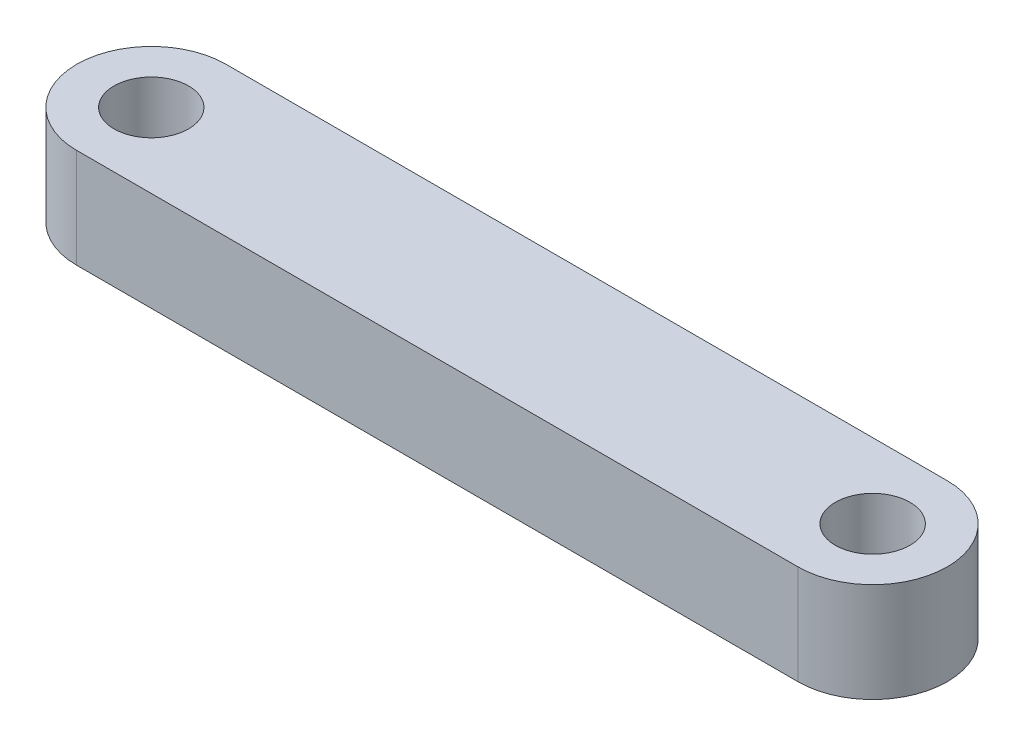
ISO-10303-21;
HEADER;
FILE_DESCRIPTION(('STEP AP214'),'2;1');
FILE_NAME('part.step','',(''),(''),'','','');
FILE_SCHEMA(('AUTOMOTIVE_DESIGN { 1 0 10303 214 1 1 1 1 }'));
ENDSEC;
DATA;
#1=APPLICATION_CONTEXT('core data for automotive mechanical design processes');
#2=APPLICATION_PROTOCOL_DEFINITION('international standard','automotive_design',2000,#1);
#3=PRODUCT_CONTEXT('',#1,'mechanical');
#4=PRODUCT('Part','Part','',(#3));
#5=PRODUCT_RELATED_PRODUCT_CATEGORY('part','',(#4));
#6=PRODUCT_DEFINITION_FORMATION('','',#4);
#7=PRODUCT_DEFINITION_CONTEXT('part definition',#1,'design');
#8=PRODUCT_DEFINITION('design','',#6,#7);
#9=PRODUCT_DEFINITION_SHAPE('','',#8);
#10=(LENGTH_UNIT() NAMED_UNIT(*) SI_UNIT(.MILLI.,.METRE.));
#11=(NAMED_UNIT(*) PLANE_ANGLE_UNIT() SI_UNIT($,.RADIAN.));
#12=(NAMED_UNIT(*) SI_UNIT($,.STERADIAN.) SOLID_ANGLE_UNIT());
#13=UNCERTAINTY_MEASURE_WITH_UNIT(LENGTH_MEASURE(1.E-05),#10,'distance_accuracy_value','');
#14=(GEOMETRIC_REPRESENTATION_CONTEXT(3) GLOBAL_UNCERTAINTY_ASSIGNED_CONTEXT((#13)) GLOBAL_UNIT_ASSIGNED_CONTEXT((#10,
#11,#12)) REPRESENTATION_CONTEXT('',''));
#15=CARTESIAN_POINT('',(0.,0.,0.));
#16=DIRECTION('',(0.,0.,1.));
#17=DIRECTION('',(1.,0.,0.));
#18=AXIS2_PLACEMENT_3D('',#15,#16,#17);
#19=CARTESIAN_POINT('',(-14.9954696871734,4.,-1.3625230433021));
#20=DIRECTION('',(0.,1.,0.));
#21=DIRECTION('',(0.,0.,1.));
#22=AXIS2_PLACEMENT_3D('',#19,#20,#21);
#23=PLANE('',#22);
#24=CARTESIAN_POINT('',(14.0045303530668,4.,-1.36252313888987));
#25=DIRECTION('',(0.,1.,0.));
#26=DIRECTION('',(0.,0.,1.));
#27=AXIS2_PLACEMENT_3D('',#24,#25,#26);
#28=CIRCLE('',#27,1.50000015052541);
#29=CARTESIAN_POINT('',(14.0045303530668,4.,0.13747701163554));
#30=VERTEX_POINT('',#29);
#31=EDGE_CURVE('E112',#30,#30,#28,.T.);
#32=ORIENTED_EDGE('',*,*,#31,.F.);
#33=EDGE_LOOP('',(#32));
#34=FACE_BOUND('',#33,.T.);
#35=CARTESIAN_POINT('',(-14.9954696871734,4.,-1.3625230433021));
#36=DIRECTION('',(0.,1.,0.));
#37=DIRECTION('',(0.,0.,1.));
#38=AXIS2_PLACEMENT_3D('',#35,#36,#37);
#39=CIRCLE('',#38,2.99999750954262);
#40=CARTESIAN_POINT('',(-14.9954696871734,4.,-4.36252055284472));
#41=VERTEX_POINT('',#40);
#42=CARTESIAN_POINT('',(-14.9954696871734,4.,1.63747446624052));
#43=VERTEX_POINT('',#42);
#44=EDGE_CURVE('E92',#41,#43,#39,.T.);
#45=ORIENTED_EDGE('',*,*,#44,.T.);
#46=DIRECTION('',(1.,0.,0.));
#47=VECTOR('',#46,1.);
#48=CARTESIAN_POINT('',(14.0045404200547,4.,1.63747446624052));
#49=LINE('',#48,#47);
#50=CARTESIAN_POINT('',(14.0045404200547,4.,1.63747446624052));
#51=VERTEX_POINT('',#50);
#52=EDGE_CURVE('E87',#43,#51,#49,.T.);
#53=ORIENTED_EDGE('',*,*,#52,.T.);
#54=CARTESIAN_POINT('',(14.0045404200547,4.,-1.3625230433021));
#55=DIRECTION('',(0.,1.,0.));
#56=DIRECTION('',(0.,0.,1.));
#57=AXIS2_PLACEMENT_3D('',#54,#55,#56);
#58=CIRCLE('',#57,2.99999750954262);
#59=CARTESIAN_POINT('',(14.0045404200547,4.,-4.36252055284472));
#60=VERTEX_POINT('',#59);
#61=EDGE_CURVE('E90',#51,#60,#58,.T.);
#62=ORIENTED_EDGE('',*,*,#61,.T.);
#63=DIRECTION('',(-1.,0.,0.));
#64=VECTOR('',#63,1.);
#65=CARTESIAN_POINT('',(-14.9954696871734,4.,-4.36252055284472));
#66=LINE('',#65,#64);
#67=EDGE_CURVE('E57',#60,#41,#66,.T.);
#68=ORIENTED_EDGE('',*,*,#67,.T.);
#69=EDGE_LOOP('',(#45,#53,#62,#68));
#70=FACE_BOUND('',#69,.T.);
#71=CARTESIAN_POINT('',(-14.9936776207104,4.,-1.35896826009357));
#72=DIRECTION('',(0.,1.,0.));
#73=DIRECTION('',(0.,0.,1.));
#74=AXIS2_PLACEMENT_3D('',#71,#72,#73);
#75=CIRCLE('',#74,1.49852008747108);
#76=CARTESIAN_POINT('',(-14.9936776207104,4.,0.139551827377501));
#77=VERTEX_POINT('',#76);
#78=EDGE_CURVE('E134',#77,#77,#75,.T.);
#79=ORIENTED_EDGE('',*,*,#78,.F.);
#80=EDGE_LOOP('',(#79));
#81=FACE_BOUND('',#80,.T.);
#82=ADVANCED_FACE('F39',(#34,#70,#81),#23,.T.);
#83=CARTESIAN_POINT('',(-14.9954696871734,0.,-1.3625230433021));
#84=DIRECTION('',(0.,1.,0.));
#85=DIRECTION('',(0.,0.,1.));
#86=AXIS2_PLACEMENT_3D('',#83,#84,#85);
#87=PLANE('',#86);
#88=CARTESIAN_POINT('',(-14.9954696871734,0.,-1.3625230433021));
#89=DIRECTION('',(0.,1.,0.));
#90=DIRECTION('',(0.,0.,1.));
#91=AXIS2_PLACEMENT_3D('',#88,#89,#90);
#92=CIRCLE('',#91,2.99999750954262);
#93=CARTESIAN_POINT('',(-14.9954696871734,0.,-4.36252055284472));
#94=VERTEX_POINT('',#93);
#95=CARTESIAN_POINT('',(-14.9954696871734,0.,1.63747446624052));
#96=VERTEX_POINT('',#95);
#97=EDGE_CURVE('E108',#94,#96,#92,.T.);
#98=ORIENTED_EDGE('',*,*,#97,.F.);
#99=DIRECTION('',(-1.,0.,0.));
#100=VECTOR('',#99,1.);
#101=CARTESIAN_POINT('',(-14.9954696871734,0.,-4.36252055284472));
#102=LINE('',#101,#100);
#103=CARTESIAN_POINT('',(14.0045404200547,0.,-4.36252055284472));
#104=VERTEX_POINT('',#103);
#105=EDGE_CURVE('E80',#104,#94,#102,.T.);
#106=ORIENTED_EDGE('',*,*,#105,.F.);
#107=CARTESIAN_POINT('',(14.0045404200547,0.,-1.3625230433021));
#108=DIRECTION('',(0.,1.,0.));
#109=DIRECTION('',(0.,0.,1.));
#110=AXIS2_PLACEMENT_3D('',#107,#108,#109);
#111=CIRCLE('',#110,2.99999750954262);
#112=CARTESIAN_POINT('',(14.0045404200547,0.,1.63747446624052));
#113=VERTEX_POINT('',#112);
#114=EDGE_CURVE('E74',#113,#104,#111,.T.);
#115=ORIENTED_EDGE('',*,*,#114,.F.);
#116=DIRECTION('',(1.,0.,0.));
#117=VECTOR('',#116,1.);
#118=CARTESIAN_POINT('',(14.0045404200547,0.,1.63747446624052));
#119=LINE('',#118,#117);
#120=EDGE_CURVE('E97',#96,#113,#119,.T.);
#121=ORIENTED_EDGE('',*,*,#120,.F.);
#122=EDGE_LOOP('',(#98,#106,#115,#121));
#123=FACE_BOUND('',#122,.T.);
#124=CARTESIAN_POINT('',(14.0045303530668,0.,-1.36252313888987));
#125=DIRECTION('',(0.,1.,0.));
#126=DIRECTION('',(0.,0.,1.));
#127=AXIS2_PLACEMENT_3D('',#124,#125,#126);
#128=CIRCLE('',#127,1.50000015052541);
#129=CARTESIAN_POINT('',(14.0045303530668,0.,0.13747701163554));
#130=VERTEX_POINT('',#129);
#131=EDGE_CURVE('E130',#130,#130,#128,.T.);
#132=ORIENTED_EDGE('',*,*,#131,.T.);
#133=EDGE_LOOP('',(#132));
#134=FACE_BOUND('',#133,.T.);
#135=CARTESIAN_POINT('',(-14.9936776207104,0.,-1.35896826009357));
#136=DIRECTION('',(0.,1.,0.));
#137=DIRECTION('',(0.,0.,1.));
#138=AXIS2_PLACEMENT_3D('',#135,#136,#137);
#139=CIRCLE('',#138,1.49852008747108);
#140=CARTESIAN_POINT('',(-14.9936776207104,0.,0.139551827377501));
#141=VERTEX_POINT('',#140);
#142=EDGE_CURVE('E138',#141,#141,#139,.T.);
#143=ORIENTED_EDGE('',*,*,#142,.T.);
#144=EDGE_LOOP('',(#143));
#145=FACE_BOUND('',#144,.T.);
#146=ADVANCED_FACE('F125',(#123,#134,#145),#87,.F.);
#147=CARTESIAN_POINT('',(-14.9954696871734,4.,-1.3625230433021));
#148=DIRECTION('',(0.,-1.,0.));
#149=DIRECTION('',(0.,0.,-1.));
#150=AXIS2_PLACEMENT_3D('',#147,#148,#149);
#151=CYLINDRICAL_SURFACE('',#150,2.99999750954262);
#152=ORIENTED_EDGE('',*,*,#97,.T.);
#153=DIRECTION('',(0.,-1.,0.));
#154=VECTOR('',#153,1.);
#155=CARTESIAN_POINT('',(-14.9954696871734,4.,1.63747446624052));
#156=LINE('',#155,#154);
#157=EDGE_CURVE('E11',#43,#96,#156,.T.);
#158=ORIENTED_EDGE('',*,*,#157,.F.);
#159=ORIENTED_EDGE('',*,*,#44,.F.);
#160=DIRECTION('',(0.,-1.,0.));
#161=VECTOR('',#160,1.);
#162=CARTESIAN_POINT('',(-14.9954696871734,4.,-4.36252055284472));
#163=LINE('',#162,#161);
#164=EDGE_CURVE('E104',#41,#94,#163,.T.);
#165=ORIENTED_EDGE('',*,*,#164,.T.);
#166=EDGE_LOOP('',(#152,#158,#159,#165));
#167=FACE_BOUND('',#166,.T.);
#168=ADVANCED_FACE('F41',(#167),#151,.T.);
#169=CARTESIAN_POINT('',(14.0045404200547,4.,1.63747446624052));
#170=DIRECTION('',(0.,0.,-1.));
#171=DIRECTION('',(-1.,0.,0.));
#172=AXIS2_PLACEMENT_3D('',#169,#170,#171);
#173=PLANE('',#172);
#174=ORIENTED_EDGE('',*,*,#120,.T.);
#175=DIRECTION('',(0.,-1.,0.));
#176=VECTOR('',#175,1.);
#177=CARTESIAN_POINT('',(14.0045404200547,4.,1.63747446624052));
#178=LINE('',#177,#176);
#179=EDGE_CURVE('E49',#51,#113,#178,.T.);
#180=ORIENTED_EDGE('',*,*,#179,.F.);
#181=ORIENTED_EDGE('',*,*,#52,.F.);
#182=ORIENTED_EDGE('',*,*,#157,.T.);
#183=EDGE_LOOP('',(#174,#180,#181,#182));
#184=FACE_BOUND('',#183,.T.);
#185=ADVANCED_FACE('F96',(#184),#173,.F.);
#186=CARTESIAN_POINT('',(14.0045404200547,4.,-1.3625230433021));
#187=DIRECTION('',(0.,-1.,0.));
#188=DIRECTION('',(0.,0.,-1.));
#189=AXIS2_PLACEMENT_3D('',#186,#187,#188);
#190=CYLINDRICAL_SURFACE('',#189,2.99999750954262);
#191=ORIENTED_EDGE('',*,*,#114,.T.);
#192=DIRECTION('',(0.,-1.,0.));
#193=VECTOR('',#192,1.);
#194=CARTESIAN_POINT('',(14.0045404200547,4.,-4.36252055284472));
#195=LINE('',#194,#193);
#196=EDGE_CURVE('E99',#60,#104,#195,.T.);
#197=ORIENTED_EDGE('',*,*,#196,.F.);
#198=ORIENTED_EDGE('',*,*,#61,.F.);
#199=ORIENTED_EDGE('',*,*,#179,.T.);
#200=EDGE_LOOP('',(#191,#197,#198,#199));
#201=FACE_BOUND('',#200,.T.);
#202=ADVANCED_FACE('F100',(#201),#190,.T.);
#203=CARTESIAN_POINT('',(-14.9954696871734,4.,-4.36252055284472));
#204=DIRECTION('',(0.,0.,1.));
#205=DIRECTION('',(1.,0.,0.));
#206=AXIS2_PLACEMENT_3D('',#203,#204,#205);
#207=PLANE('',#206);
#208=ORIENTED_EDGE('',*,*,#105,.T.);
#209=ORIENTED_EDGE('',*,*,#164,.F.);
#210=ORIENTED_EDGE('',*,*,#67,.F.);
#211=ORIENTED_EDGE('',*,*,#196,.T.);
#212=EDGE_LOOP('',(#208,#209,#210,#211));
#213=FACE_BOUND('',#212,.T.);
#214=ADVANCED_FACE('F122',(#213),#207,.F.);
#215=CARTESIAN_POINT('',(14.0045303530668,4.,-1.36252313888987));
#216=DIRECTION('',(0.,-1.,0.));
#217=DIRECTION('',(0.,0.,-1.));
#218=AXIS2_PLACEMENT_3D('',#215,#216,#217);
#219=CYLINDRICAL_SURFACE('',#218,1.50000015052541);
#220=ORIENTED_EDGE('',*,*,#31,.T.);
#221=EDGE_LOOP('',(#220));
#222=FACE_BOUND('',#221,.T.);
#223=ORIENTED_EDGE('',*,*,#131,.F.);
#224=EDGE_LOOP('',(#223));
#225=FACE_BOUND('',#224,.T.);
#226=ADVANCED_FACE('F157',(#222,#225),#219,.F.);
#227=CARTESIAN_POINT('',(-14.9936776207104,4.,-1.35896826009357));
#228=DIRECTION('',(0.,-1.,0.));
#229=DIRECTION('',(0.,0.,-1.));
#230=AXIS2_PLACEMENT_3D('',#227,#228,#229);
#231=CYLINDRICAL_SURFACE('',#230,1.49852008747108);
#232=ORIENTED_EDGE('',*,*,#78,.T.);
#233=EDGE_LOOP('',(#232));
#234=FACE_BOUND('',#233,.T.);
#235=ORIENTED_EDGE('',*,*,#142,.F.);
#236=EDGE_LOOP('',(#235));
#237=FACE_BOUND('',#236,.T.);
#238=ADVANCED_FACE('F146',(#234,#237),#231,.F.);
#239=CLOSED_SHELL('',(#82,#146,#168,#185,#202,#214,#226,#238));
#240=MANIFOLD_SOLID_BREP('B2',#239);
#241=ADVANCED_BREP_SHAPE_REPRESENTATION('',(#18,#240),#14);
#242=SHAPE_DEFINITION_REPRESENTATION(#9,#241);
ENDSEC;
END-ISO-10303-21;
